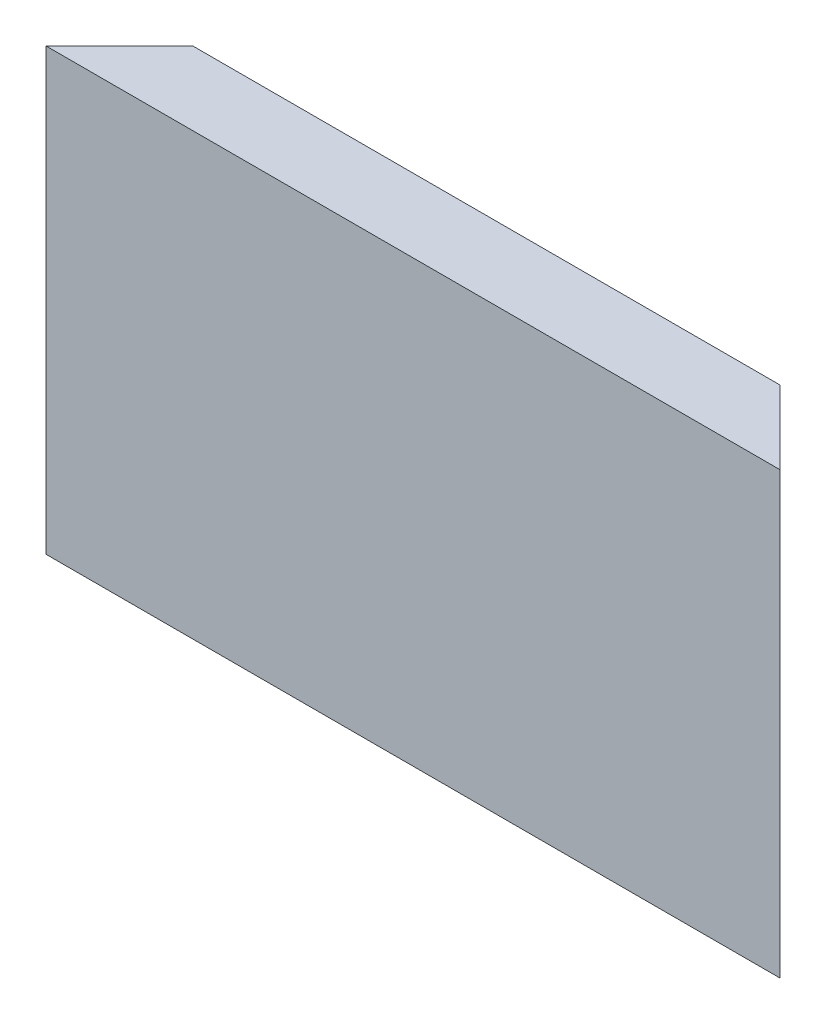
ISO-10303-21;
HEADER;
FILE_DESCRIPTION(('STEP AP214'),'2;1');
FILE_NAME('part.step','',(''),(''),'','','');
FILE_SCHEMA(('AUTOMOTIVE_DESIGN { 1 0 10303 214 1 1 1 1 }'));
ENDSEC;
DATA;
#1=APPLICATION_CONTEXT('core data for automotive mechanical design processes');
#2=APPLICATION_PROTOCOL_DEFINITION('international standard','automotive_design',2000,#1);
#3=PRODUCT_CONTEXT('',#1,'mechanical');
#4=PRODUCT('Part','Part','',(#3));
#5=PRODUCT_RELATED_PRODUCT_CATEGORY('part','',(#4));
#6=PRODUCT_DEFINITION_FORMATION('','',#4);
#7=PRODUCT_DEFINITION_CONTEXT('part definition',#1,'design');
#8=PRODUCT_DEFINITION('design','',#6,#7);
#9=PRODUCT_DEFINITION_SHAPE('','',#8);
#10=(LENGTH_UNIT() NAMED_UNIT(*) SI_UNIT(.MILLI.,.METRE.));
#11=(NAMED_UNIT(*) PLANE_ANGLE_UNIT() SI_UNIT($,.RADIAN.));
#12=(NAMED_UNIT(*) SI_UNIT($,.STERADIAN.) SOLID_ANGLE_UNIT());
#13=UNCERTAINTY_MEASURE_WITH_UNIT(LENGTH_MEASURE(1.E-05),#10,'distance_accuracy_value','');
#14=(GEOMETRIC_REPRESENTATION_CONTEXT(3) GLOBAL_UNCERTAINTY_ASSIGNED_CONTEXT((#13)) GLOBAL_UNIT_ASSIGNED_CONTEXT((#10,
#11,#12)) REPRESENTATION_CONTEXT('',''));
#15=CARTESIAN_POINT('',(0.,0.,0.));
#16=DIRECTION('',(0.,0.,1.));
#17=DIRECTION('',(1.,0.,0.));
#18=AXIS2_PLACEMENT_3D('',#15,#16,#17);
#19=CARTESIAN_POINT('',(-25.,15.,5.));
#20=DIRECTION('',(0.,-1.,0.));
#21=DIRECTION('',(0.,0.,-1.));
#22=AXIS2_PLACEMENT_3D('',#19,#20,#21);
#23=PLANE('',#22);
#24=DIRECTION('',(-1.,0.,0.));
#25=VECTOR('',#24,1.);
#26=CARTESIAN_POINT('',(-25.,15.,0.));
#27=LINE('',#26,#25);
#28=CARTESIAN_POINT('',(20.,15.,0.));
#29=VERTEX_POINT('',#28);
#30=CARTESIAN_POINT('',(-20.,15.,0.));
#31=VERTEX_POINT('',#30);
#32=EDGE_CURVE('E91',#29,#31,#27,.T.);
#33=ORIENTED_EDGE('',*,*,#32,.T.);
#34=DIRECTION('',(0.707106781186551,0.,-0.707106781186544));
#35=VECTOR('',#34,1.);
#36=CARTESIAN_POINT('',(-25.,15.,5.));
#37=LINE('',#36,#35);
#38=CARTESIAN_POINT('',(-25.,15.,5.));
#39=VERTEX_POINT('',#38);
#40=EDGE_CURVE('E85',#39,#31,#37,.T.);
#41=ORIENTED_EDGE('',*,*,#40,.F.);
#42=DIRECTION('',(-1.,0.,0.));
#43=VECTOR('',#42,1.);
#44=CARTESIAN_POINT('',(-25.,15.,5.));
#45=LINE('',#44,#43);
#46=CARTESIAN_POINT('',(25.,15.,5.));
#47=VERTEX_POINT('',#46);
#48=EDGE_CURVE('E84',#47,#39,#45,.T.);
#49=ORIENTED_EDGE('',*,*,#48,.F.);
#50=DIRECTION('',(0.707106781186546,0.,0.707106781186549));
#51=VECTOR('',#50,1.);
#52=CARTESIAN_POINT('',(25.,15.,5.));
#53=LINE('',#52,#51);
#54=EDGE_CURVE('E69',#29,#47,#53,.T.);
#55=ORIENTED_EDGE('',*,*,#54,.F.);
#56=EDGE_LOOP('',(#33,#41,#49,#55));
#57=FACE_BOUND('',#56,.T.);
#58=ADVANCED_FACE('F33',(#57),#23,.F.);
#59=CARTESIAN_POINT('',(0.,0.,5.));
#60=DIRECTION('',(0.,0.,1.));
#61=DIRECTION('',(1.,0.,0.));
#62=AXIS2_PLACEMENT_3D('',#59,#60,#61);
#63=PLANE('',#62);
#64=DIRECTION('',(0.,1.,0.));
#65=VECTOR('',#64,1.);
#66=CARTESIAN_POINT('',(25.,15.,5.));
#67=LINE('',#66,#65);
#68=CARTESIAN_POINT('',(25.,-15.,5.));
#69=VERTEX_POINT('',#68);
#70=EDGE_CURVE('E75',#69,#47,#67,.T.);
#71=ORIENTED_EDGE('',*,*,#70,.T.);
#72=ORIENTED_EDGE('',*,*,#48,.T.);
#73=DIRECTION('',(0.,-1.,0.));
#74=VECTOR('',#73,1.);
#75=CARTESIAN_POINT('',(-25.,15.,5.));
#76=LINE('',#75,#74);
#77=CARTESIAN_POINT('',(-25.,-15.,5.));
#78=VERTEX_POINT('',#77);
#79=EDGE_CURVE('E88',#39,#78,#76,.T.);
#80=ORIENTED_EDGE('',*,*,#79,.T.);
#81=DIRECTION('',(1.,0.,0.));
#82=VECTOR('',#81,1.);
#83=CARTESIAN_POINT('',(-25.,-15.,5.));
#84=LINE('',#83,#82);
#85=EDGE_CURVE('E40',#78,#69,#84,.T.);
#86=ORIENTED_EDGE('',*,*,#85,.T.);
#87=EDGE_LOOP('',(#71,#72,#80,#86));
#88=FACE_BOUND('',#87,.T.);
#89=ADVANCED_FACE('F90',(#88),#63,.T.);
#90=CARTESIAN_POINT('',(0.,0.,0.));
#91=DIRECTION('',(0.,0.,1.));
#92=DIRECTION('',(1.,0.,0.));
#93=AXIS2_PLACEMENT_3D('',#90,#91,#92);
#94=PLANE('',#93);
#95=DIRECTION('',(0.,1.,0.));
#96=VECTOR('',#95,1.);
#97=CARTESIAN_POINT('',(20.,-15.,0.));
#98=LINE('',#97,#96);
#99=CARTESIAN_POINT('',(20.,-10.,0.));
#100=VERTEX_POINT('',#99);
#101=EDGE_CURVE('E77',#100,#29,#98,.T.);
#102=ORIENTED_EDGE('',*,*,#101,.F.);
#103=DIRECTION('',(1.,0.,0.));
#104=VECTOR('',#103,1.);
#105=CARTESIAN_POINT('',(-25.,-10.,0.));
#106=LINE('',#105,#104);
#107=CARTESIAN_POINT('',(-19.9999999999999,-10.,0.));
#108=VERTEX_POINT('',#107);
#109=EDGE_CURVE('E101',#108,#100,#106,.T.);
#110=ORIENTED_EDGE('',*,*,#109,.F.);
#111=DIRECTION('',(0.,1.,0.));
#112=VECTOR('',#111,1.);
#113=CARTESIAN_POINT('',(-20.,-15.,0.));
#114=LINE('',#113,#112);
#115=EDGE_CURVE('E47',#108,#31,#114,.T.);
#116=ORIENTED_EDGE('',*,*,#115,.T.);
#117=ORIENTED_EDGE('',*,*,#32,.F.);
#118=EDGE_LOOP('',(#102,#110,#116,#117));
#119=FACE_BOUND('',#118,.T.);
#120=ADVANCED_FACE('F102',(#119),#94,.F.);
#121=CARTESIAN_POINT('',(25.,-15.,5.));
#122=DIRECTION('',(-0.707106781186549,0.,0.707106781186546));
#123=DIRECTION('',(0.707106781186546,0.,0.707106781186549));
#124=AXIS2_PLACEMENT_3D('',#121,#122,#123);
#125=PLANE('',#124);
#126=ORIENTED_EDGE('',*,*,#70,.F.);
#127=DIRECTION('',(-0.577350269189625,0.577350269189625,-0.577350269189627));
#128=VECTOR('',#127,1.);
#129=CARTESIAN_POINT('',(25.,-15.,5.));
#130=LINE('',#129,#128);
#131=EDGE_CURVE('E80',#69,#100,#130,.T.);
#132=ORIENTED_EDGE('',*,*,#131,.T.);
#133=ORIENTED_EDGE('',*,*,#101,.T.);
#134=ORIENTED_EDGE('',*,*,#54,.T.);
#135=EDGE_LOOP('',(#126,#132,#133,#134));
#136=FACE_BOUND('',#135,.T.);
#137=ADVANCED_FACE('F71',(#136),#125,.F.);
#138=CARTESIAN_POINT('',(-25.,-15.,5.));
#139=DIRECTION('',(0.707106781186544,0.,0.707106781186551));
#140=DIRECTION('',(0.707106781186551,0.,-0.707106781186544));
#141=AXIS2_PLACEMENT_3D('',#138,#139,#140);
#142=PLANE('',#141);
#143=ORIENTED_EDGE('',*,*,#115,.F.);
#144=DIRECTION('',(-0.57735026918963,-0.577350269189623,0.577350269189624));
#145=VECTOR('',#144,1.);
#146=CARTESIAN_POINT('',(-25.,-15.,5.));
#147=LINE('',#146,#145);
#148=EDGE_CURVE('E11',#108,#78,#147,.T.);
#149=ORIENTED_EDGE('',*,*,#148,.T.);
#150=ORIENTED_EDGE('',*,*,#79,.F.);
#151=ORIENTED_EDGE('',*,*,#40,.T.);
#152=EDGE_LOOP('',(#143,#149,#150,#151));
#153=FACE_BOUND('',#152,.T.);
#154=ADVANCED_FACE('F97',(#153),#142,.F.);
#155=CARTESIAN_POINT('',(-25.,-15.,5.));
#156=DIRECTION('',(0.,0.707106781186549,0.707106781186547));
#157=DIRECTION('',(0.,-0.707106781186547,0.707106781186549));
#158=AXIS2_PLACEMENT_3D('',#155,#156,#157);
#159=PLANE('',#158);
#160=ORIENTED_EDGE('',*,*,#85,.F.);
#161=ORIENTED_EDGE('',*,*,#148,.F.);
#162=ORIENTED_EDGE('',*,*,#109,.T.);
#163=ORIENTED_EDGE('',*,*,#131,.F.);
#164=EDGE_LOOP('',(#160,#161,#162,#163));
#165=FACE_BOUND('',#164,.T.);
#166=ADVANCED_FACE('F100',(#165),#159,.F.);
#167=CLOSED_SHELL('',(#58,#89,#120,#137,#154,#166));
#168=MANIFOLD_SOLID_BREP('B2',#167);
#169=ADVANCED_BREP_SHAPE_REPRESENTATION('',(#18,#168),#14);
#170=SHAPE_DEFINITION_REPRESENTATION(#9,#169);
ENDSEC;
END-ISO-10303-21;
